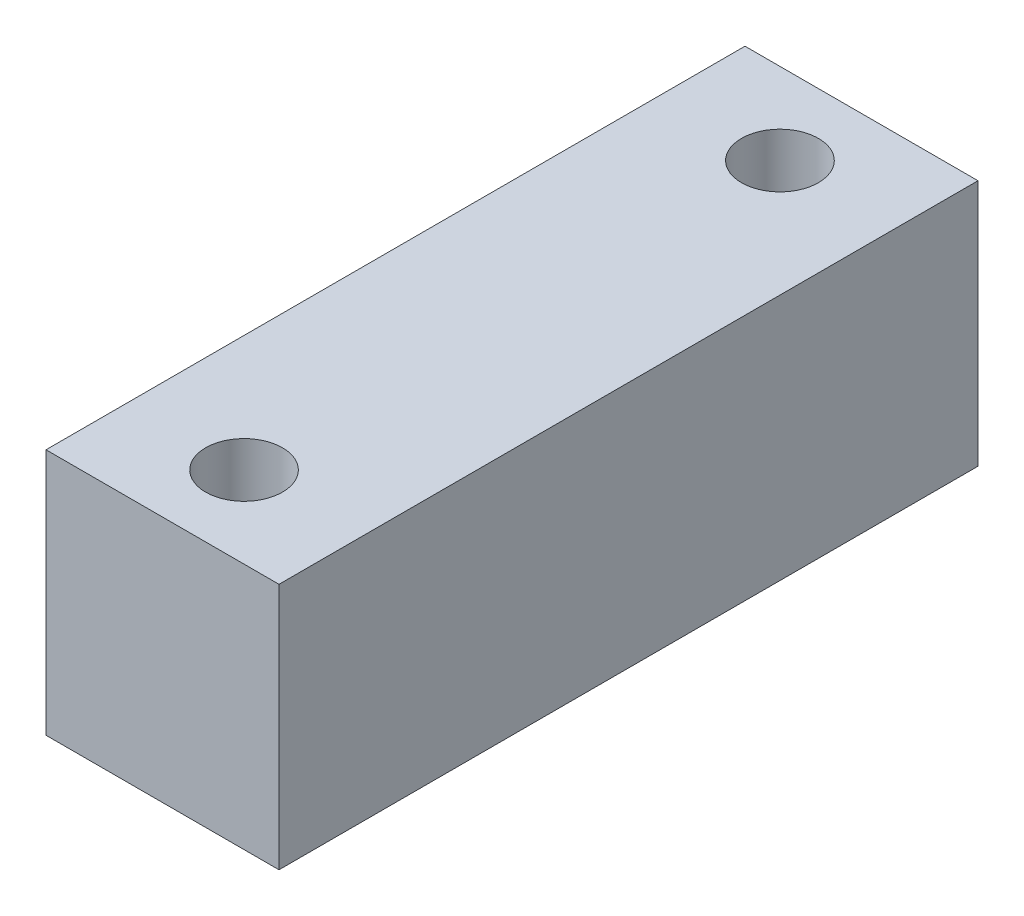
ISO-10303-21;
HEADER;
FILE_DESCRIPTION(('STEP AP214'),'2;1');
FILE_NAME('part.step','',(''),(''),'','','');
FILE_SCHEMA(('AUTOMOTIVE_DESIGN { 1 0 10303 214 1 1 1 1 }'));
ENDSEC;
DATA;
#1=APPLICATION_CONTEXT('core data for automotive mechanical design processes');
#2=APPLICATION_PROTOCOL_DEFINITION('international standard','automotive_design',2000,#1);
#3=PRODUCT_CONTEXT('',#1,'mechanical');
#4=PRODUCT('Part','Part','',(#3));
#5=PRODUCT_RELATED_PRODUCT_CATEGORY('part','',(#4));
#6=PRODUCT_DEFINITION_FORMATION('','',#4);
#7=PRODUCT_DEFINITION_CONTEXT('part definition',#1,'design');
#8=PRODUCT_DEFINITION('design','',#6,#7);
#9=PRODUCT_DEFINITION_SHAPE('','',#8);
#10=(LENGTH_UNIT() NAMED_UNIT(*) SI_UNIT(.MILLI.,.METRE.));
#11=(NAMED_UNIT(*) PLANE_ANGLE_UNIT() SI_UNIT($,.RADIAN.));
#12=(NAMED_UNIT(*) SI_UNIT($,.STERADIAN.) SOLID_ANGLE_UNIT());
#13=UNCERTAINTY_MEASURE_WITH_UNIT(LENGTH_MEASURE(1.E-05),#10,'distance_accuracy_value','');
#14=(GEOMETRIC_REPRESENTATION_CONTEXT(3) GLOBAL_UNCERTAINTY_ASSIGNED_CONTEXT((#13)) GLOBAL_UNIT_ASSIGNED_CONTEXT((#10,
#11,#12)) REPRESENTATION_CONTEXT('',''));
#15=CARTESIAN_POINT('',(0.,0.,0.));
#16=DIRECTION('',(0.,0.,1.));
#17=DIRECTION('',(1.,0.,0.));
#18=AXIS2_PLACEMENT_3D('',#15,#16,#17);
#19=CARTESIAN_POINT('',(0.,21.22424,0.));
#20=DIRECTION('',(0.,1.,0.));
#21=DIRECTION('',(0.,0.,1.));
#22=AXIS2_PLACEMENT_3D('',#19,#20,#21);
#23=PLANE('',#22);
#24=CARTESIAN_POINT('',(-10.,21.22424,-23.));
#25=DIRECTION('',(0.,1.,0.));
#26=DIRECTION('',(0.,0.,1.));
#27=AXIS2_PLACEMENT_3D('',#24,#25,#26);
#28=CIRCLE('',#27,3.2999999999906);
#29=CARTESIAN_POINT('',(-10.,21.22424,-19.7000000000094));
#30=VERTEX_POINT('',#29);
#31=EDGE_CURVE('E99',#30,#30,#28,.T.);
#32=ORIENTED_EDGE('',*,*,#31,.F.);
#33=EDGE_LOOP('',(#32));
#34=FACE_BOUND('',#33,.T.);
#35=DIRECTION('',(0.,0.,-1.));
#36=VECTOR('',#35,1.);
#37=CARTESIAN_POINT('',(0.,21.22424,30.));
#38=LINE('',#37,#36);
#39=CARTESIAN_POINT('',(0.,21.22424,30.));
#40=VERTEX_POINT('',#39);
#41=CARTESIAN_POINT('',(0.,21.22424,-30.));
#42=VERTEX_POINT('',#41);
#43=EDGE_CURVE('E84',#40,#42,#38,.T.);
#44=ORIENTED_EDGE('',*,*,#43,.T.);
#45=DIRECTION('',(-1.,0.,0.));
#46=VECTOR('',#45,1.);
#47=CARTESIAN_POINT('',(0.,21.22424,-30.));
#48=LINE('',#47,#46);
#49=CARTESIAN_POINT('',(-20.,21.22424,-30.));
#50=VERTEX_POINT('',#49);
#51=EDGE_CURVE('E79',#42,#50,#48,.T.);
#52=ORIENTED_EDGE('',*,*,#51,.T.);
#53=DIRECTION('',(0.,0.,1.));
#54=VECTOR('',#53,1.);
#55=CARTESIAN_POINT('',(-20.,21.22424,30.));
#56=LINE('',#55,#54);
#57=CARTESIAN_POINT('',(-20.,21.22424,30.));
#58=VERTEX_POINT('',#57);
#59=EDGE_CURVE('E82',#50,#58,#56,.T.);
#60=ORIENTED_EDGE('',*,*,#59,.T.);
#61=DIRECTION('',(1.,0.,0.));
#62=VECTOR('',#61,1.);
#63=CARTESIAN_POINT('',(0.,21.22424,30.));
#64=LINE('',#63,#62);
#65=EDGE_CURVE('E49',#58,#40,#64,.T.);
#66=ORIENTED_EDGE('',*,*,#65,.T.);
#67=EDGE_LOOP('',(#44,#52,#60,#66));
#68=FACE_BOUND('',#67,.T.);
#69=CARTESIAN_POINT('',(-10.,21.22424,23.));
#70=DIRECTION('',(0.,1.,0.));
#71=DIRECTION('',(0.,0.,1.));
#72=AXIS2_PLACEMENT_3D('',#69,#70,#71);
#73=CIRCLE('',#72,3.29999999999062);
#74=CARTESIAN_POINT('',(-10.,21.22424,26.2999999999906));
#75=VERTEX_POINT('',#74);
#76=EDGE_CURVE('E114',#75,#75,#73,.T.);
#77=ORIENTED_EDGE('',*,*,#76,.F.);
#78=EDGE_LOOP('',(#77));
#79=FACE_BOUND('',#78,.T.);
#80=ADVANCED_FACE('F32',(#34,#68,#79),#23,.T.);
#81=CARTESIAN_POINT('',(0.,0.,0.));
#82=DIRECTION('',(0.,1.,0.));
#83=DIRECTION('',(0.,0.,1.));
#84=AXIS2_PLACEMENT_3D('',#81,#82,#83);
#85=PLANE('',#84);
#86=DIRECTION('',(0.,0.,-1.));
#87=VECTOR('',#86,1.);
#88=CARTESIAN_POINT('',(0.,0.,30.));
#89=LINE('',#88,#87);
#90=CARTESIAN_POINT('',(0.,0.,30.));
#91=VERTEX_POINT('',#90);
#92=CARTESIAN_POINT('',(0.,0.,-30.));
#93=VERTEX_POINT('',#92);
#94=EDGE_CURVE('E96',#91,#93,#89,.T.);
#95=ORIENTED_EDGE('',*,*,#94,.F.);
#96=DIRECTION('',(1.,0.,0.));
#97=VECTOR('',#96,1.);
#98=CARTESIAN_POINT('',(0.,0.,30.));
#99=LINE('',#98,#97);
#100=CARTESIAN_POINT('',(-20.,0.,30.));
#101=VERTEX_POINT('',#100);
#102=EDGE_CURVE('E72',#101,#91,#99,.T.);
#103=ORIENTED_EDGE('',*,*,#102,.F.);
#104=DIRECTION('',(0.,0.,1.));
#105=VECTOR('',#104,1.);
#106=CARTESIAN_POINT('',(-20.,0.,30.));
#107=LINE('',#106,#105);
#108=CARTESIAN_POINT('',(-20.,0.,-30.));
#109=VERTEX_POINT('',#108);
#110=EDGE_CURVE('E66',#109,#101,#107,.T.);
#111=ORIENTED_EDGE('',*,*,#110,.F.);
#112=DIRECTION('',(-1.,0.,0.));
#113=VECTOR('',#112,1.);
#114=CARTESIAN_POINT('',(0.,0.,-30.));
#115=LINE('',#114,#113);
#116=EDGE_CURVE('E88',#93,#109,#115,.T.);
#117=ORIENTED_EDGE('',*,*,#116,.F.);
#118=EDGE_LOOP('',(#95,#103,#111,#117));
#119=FACE_BOUND('',#118,.T.);
#120=CARTESIAN_POINT('',(-10.,0.,-23.));
#121=DIRECTION('',(0.,1.,0.));
#122=DIRECTION('',(0.,0.,1.));
#123=AXIS2_PLACEMENT_3D('',#120,#121,#122);
#124=CIRCLE('',#123,3.2999999999906);
#125=CARTESIAN_POINT('',(-10.,0.,-19.7000000000094));
#126=VERTEX_POINT('',#125);
#127=EDGE_CURVE('E111',#126,#126,#124,.T.);
#128=ORIENTED_EDGE('',*,*,#127,.T.);
#129=EDGE_LOOP('',(#128));
#130=FACE_BOUND('',#129,.T.);
#131=CARTESIAN_POINT('',(-10.,0.,23.));
#132=DIRECTION('',(0.,1.,0.));
#133=DIRECTION('',(0.,0.,1.));
#134=AXIS2_PLACEMENT_3D('',#131,#132,#133);
#135=CIRCLE('',#134,3.29999999999062);
#136=CARTESIAN_POINT('',(-10.,0.,26.2999999999906));
#137=VERTEX_POINT('',#136);
#138=EDGE_CURVE('E117',#137,#137,#135,.T.);
#139=ORIENTED_EDGE('',*,*,#138,.T.);
#140=EDGE_LOOP('',(#139));
#141=FACE_BOUND('',#140,.T.);
#142=ADVANCED_FACE('F107',(#119,#130,#141),#85,.F.);
#143=CARTESIAN_POINT('',(0.,21.22424,30.));
#144=DIRECTION('',(-1.,0.,0.));
#145=DIRECTION('',(0.,0.,1.));
#146=AXIS2_PLACEMENT_3D('',#143,#144,#145);
#147=PLANE('',#146);
#148=ORIENTED_EDGE('',*,*,#94,.T.);
#149=DIRECTION('',(0.,-1.,0.));
#150=VECTOR('',#149,1.);
#151=CARTESIAN_POINT('',(0.,21.22424,-30.));
#152=LINE('',#151,#150);
#153=EDGE_CURVE('E11',#42,#93,#152,.T.);
#154=ORIENTED_EDGE('',*,*,#153,.F.);
#155=ORIENTED_EDGE('',*,*,#43,.F.);
#156=DIRECTION('',(0.,-1.,0.));
#157=VECTOR('',#156,1.);
#158=CARTESIAN_POINT('',(0.,21.22424,30.));
#159=LINE('',#158,#157);
#160=EDGE_CURVE('E92',#40,#91,#159,.T.);
#161=ORIENTED_EDGE('',*,*,#160,.T.);
#162=EDGE_LOOP('',(#148,#154,#155,#161));
#163=FACE_BOUND('',#162,.T.);
#164=ADVANCED_FACE('F34',(#163),#147,.F.);
#165=CARTESIAN_POINT('',(0.,21.22424,-30.));
#166=DIRECTION('',(0.,0.,1.));
#167=DIRECTION('',(1.,0.,0.));
#168=AXIS2_PLACEMENT_3D('',#165,#166,#167);
#169=PLANE('',#168);
#170=ORIENTED_EDGE('',*,*,#116,.T.);
#171=DIRECTION('',(0.,-1.,0.));
#172=VECTOR('',#171,1.);
#173=CARTESIAN_POINT('',(-20.,21.22424,-30.));
#174=LINE('',#173,#172);
#175=EDGE_CURVE('E41',#50,#109,#174,.T.);
#176=ORIENTED_EDGE('',*,*,#175,.F.);
#177=ORIENTED_EDGE('',*,*,#51,.F.);
#178=ORIENTED_EDGE('',*,*,#153,.T.);
#179=EDGE_LOOP('',(#170,#176,#177,#178));
#180=FACE_BOUND('',#179,.T.);
#181=ADVANCED_FACE('F87',(#180),#169,.F.);
#182=CARTESIAN_POINT('',(-20.,21.22424,30.));
#183=DIRECTION('',(1.,0.,0.));
#184=DIRECTION('',(0.,0.,-1.));
#185=AXIS2_PLACEMENT_3D('',#182,#183,#184);
#186=PLANE('',#185);
#187=ORIENTED_EDGE('',*,*,#110,.T.);
#188=DIRECTION('',(0.,-1.,0.));
#189=VECTOR('',#188,1.);
#190=CARTESIAN_POINT('',(-20.,21.22424,30.));
#191=LINE('',#190,#189);
#192=EDGE_CURVE('E89',#58,#101,#191,.T.);
#193=ORIENTED_EDGE('',*,*,#192,.F.);
#194=ORIENTED_EDGE('',*,*,#59,.F.);
#195=ORIENTED_EDGE('',*,*,#175,.T.);
#196=EDGE_LOOP('',(#187,#193,#194,#195));
#197=FACE_BOUND('',#196,.T.);
#198=ADVANCED_FACE('F90',(#197),#186,.F.);
#199=CARTESIAN_POINT('',(0.,21.22424,30.));
#200=DIRECTION('',(0.,0.,-1.));
#201=DIRECTION('',(-1.,0.,0.));
#202=AXIS2_PLACEMENT_3D('',#199,#200,#201);
#203=PLANE('',#202);
#204=ORIENTED_EDGE('',*,*,#102,.T.);
#205=ORIENTED_EDGE('',*,*,#160,.F.);
#206=ORIENTED_EDGE('',*,*,#65,.F.);
#207=ORIENTED_EDGE('',*,*,#192,.T.);
#208=EDGE_LOOP('',(#204,#205,#206,#207));
#209=FACE_BOUND('',#208,.T.);
#210=ADVANCED_FACE('F104',(#209),#203,.F.);
#211=CARTESIAN_POINT('',(-10.,21.22424,-23.));
#212=DIRECTION('',(0.,-1.,0.));
#213=DIRECTION('',(0.,0.,-1.));
#214=AXIS2_PLACEMENT_3D('',#211,#212,#213);
#215=CYLINDRICAL_SURFACE('',#214,3.2999999999906);
#216=ORIENTED_EDGE('',*,*,#31,.T.);
#217=EDGE_LOOP('',(#216));
#218=FACE_BOUND('',#217,.T.);
#219=ORIENTED_EDGE('',*,*,#127,.F.);
#220=EDGE_LOOP('',(#219));
#221=FACE_BOUND('',#220,.T.);
#222=ADVANCED_FACE('F134',(#218,#221),#215,.F.);
#223=CARTESIAN_POINT('',(-10.,21.22424,23.));
#224=DIRECTION('',(0.,-1.,0.));
#225=DIRECTION('',(0.,0.,-1.));
#226=AXIS2_PLACEMENT_3D('',#223,#224,#225);
#227=CYLINDRICAL_SURFACE('',#226,3.29999999999062);
#228=ORIENTED_EDGE('',*,*,#76,.T.);
#229=EDGE_LOOP('',(#228));
#230=FACE_BOUND('',#229,.T.);
#231=ORIENTED_EDGE('',*,*,#138,.F.);
#232=EDGE_LOOP('',(#231));
#233=FACE_BOUND('',#232,.T.);
#234=ADVANCED_FACE('F123',(#230,#233),#227,.F.);
#235=CLOSED_SHELL('',(#80,#142,#164,#181,#198,#210,#222,#234));
#236=MANIFOLD_SOLID_BREP('B2',#235);
#237=ADVANCED_BREP_SHAPE_REPRESENTATION('',(#18,#236),#14);
#238=SHAPE_DEFINITION_REPRESENTATION(#9,#237);
ENDSEC;
END-ISO-10303-21;
